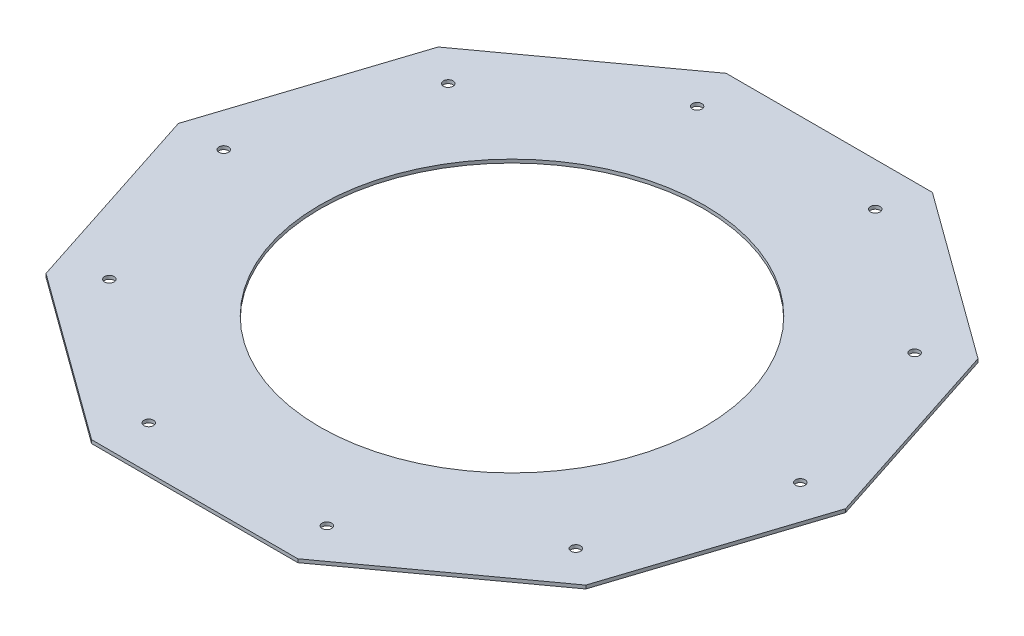
ISO-10303-21;
HEADER;
FILE_DESCRIPTION(('STEP AP214'),'2;1');
FILE_NAME('part.step','',(''),(''),'','','');
FILE_SCHEMA(('AUTOMOTIVE_DESIGN { 1 0 10303 214 1 1 1 1 }'));
ENDSEC;
DATA;
#1=APPLICATION_CONTEXT('core data for automotive mechanical design processes');
#2=APPLICATION_PROTOCOL_DEFINITION('international standard','automotive_design',2000,#1);
#3=PRODUCT_CONTEXT('',#1,'mechanical');
#4=PRODUCT('Part','Part','',(#3));
#5=PRODUCT_RELATED_PRODUCT_CATEGORY('part','',(#4));
#6=PRODUCT_DEFINITION_FORMATION('','',#4);
#7=PRODUCT_DEFINITION_CONTEXT('part definition',#1,'design');
#8=PRODUCT_DEFINITION('design','',#6,#7);
#9=PRODUCT_DEFINITION_SHAPE('','',#8);
#10=(LENGTH_UNIT() NAMED_UNIT(*) SI_UNIT(.MILLI.,.METRE.));
#11=(NAMED_UNIT(*) PLANE_ANGLE_UNIT() SI_UNIT($,.RADIAN.));
#12=(NAMED_UNIT(*) SI_UNIT($,.STERADIAN.) SOLID_ANGLE_UNIT());
#13=UNCERTAINTY_MEASURE_WITH_UNIT(LENGTH_MEASURE(1.E-05),#10,'distance_accuracy_value','');
#14=(GEOMETRIC_REPRESENTATION_CONTEXT(3) GLOBAL_UNCERTAINTY_ASSIGNED_CONTEXT((#13)) GLOBAL_UNIT_ASSIGNED_CONTEXT((#10,
#11,#12)) REPRESENTATION_CONTEXT('',''));
#15=CARTESIAN_POINT('',(0.,0.,0.));
#16=DIRECTION('',(0.,0.,1.));
#17=DIRECTION('',(1.,0.,0.));
#18=AXIS2_PLACEMENT_3D('',#15,#16,#17);
#19=CARTESIAN_POINT('',(0.,1200.,0.));
#20=DIRECTION('',(0.,1.,0.));
#21=DIRECTION('',(0.,0.,1.));
#22=AXIS2_PLACEMENT_3D('',#19,#20,#21);
#23=PLANE('',#22);
#24=CARTESIAN_POINT('',(-39.308417585108,1200.,120.978869674096));
#25=DIRECTION('',(0.,1.,0.));
#26=DIRECTION('',(0.,0.,1.));
#27=AXIS2_PLACEMENT_3D('',#24,#25,#26);
#28=CIRCLE('',#27,2.09999999999998);
#29=CARTESIAN_POINT('',(-39.308417585108,1200.,123.078869674096));
#30=VERTEX_POINT('',#29);
#31=EDGE_CURVE('E263',#30,#30,#28,.T.);
#32=ORIENTED_EDGE('',*,*,#31,.F.);
#33=EDGE_LOOP('',(#32));
#34=FACE_BOUND('',#33,.T.);
#35=CARTESIAN_POINT('',(102.91077328179,1200.,74.7690533791364));
#36=DIRECTION('',(0.,1.,0.));
#37=DIRECTION('',(0.,0.,1.));
#38=AXIS2_PLACEMENT_3D('',#35,#36,#37);
#39=CIRCLE('',#38,2.09999999999999);
#40=CARTESIAN_POINT('',(102.91077328179,1200.,76.8690533791364));
#41=VERTEX_POINT('',#40);
#42=EDGE_CURVE('E251',#41,#41,#39,.T.);
#43=ORIENTED_EDGE('',*,*,#42,.F.);
#44=EDGE_LOOP('',(#43));
#45=FACE_BOUND('',#44,.T.);
#46=CARTESIAN_POINT('',(39.3084175851137,1200.,-120.978869674102));
#47=DIRECTION('',(0.,1.,0.));
#48=DIRECTION('',(0.,0.,1.));
#49=AXIS2_PLACEMENT_3D('',#46,#47,#48);
#50=CIRCLE('',#49,2.1);
#51=CARTESIAN_POINT('',(39.3084175851137,1200.,-118.878869674102));
#52=VERTEX_POINT('',#51);
#53=EDGE_CURVE('E239',#52,#52,#50,.T.);
#54=ORIENTED_EDGE('',*,*,#53,.F.);
#55=EDGE_LOOP('',(#54));
#56=FACE_BOUND('',#55,.T.);
#57=CARTESIAN_POINT('',(-102.910773281785,1200.,-74.7690533791421));
#58=DIRECTION('',(0.,1.,0.));
#59=DIRECTION('',(0.,0.,1.));
#60=AXIS2_PLACEMENT_3D('',#57,#58,#59);
#61=CIRCLE('',#60,2.09999999999999);
#62=CARTESIAN_POINT('',(-102.910773281785,1200.,-72.6690533791421));
#63=VERTEX_POINT('',#62);
#64=EDGE_CURVE('E227',#63,#63,#61,.T.);
#65=ORIENTED_EDGE('',*,*,#64,.F.);
#66=EDGE_LOOP('',(#65));
#67=FACE_BOUND('',#66,.T.);
#68=CARTESIAN_POINT('',(-127.204711393357,1200.,-5.04680804180316E-12));
#69=DIRECTION('',(0.,1.,0.));
#70=DIRECTION('',(0.,0.,1.));
#71=AXIS2_PLACEMENT_3D('',#68,#69,#70);
#72=CIRCLE('',#71,2.09999999999999);
#73=CARTESIAN_POINT('',(-127.204711393357,1200.,2.09999999999494));
#74=VERTEX_POINT('',#73);
#75=EDGE_CURVE('E215',#74,#74,#72,.T.);
#76=ORIENTED_EDGE('',*,*,#75,.F.);
#77=EDGE_LOOP('',(#76));
#78=FACE_BOUND('',#77,.T.);
#79=DIRECTION('',(-0.309016994374947,0.,0.951056516295154));
#80=VECTOR('',#79,1.);
#81=CARTESIAN_POINT('',(-119.091113169286,1200.,-86.5247584249853));
#82=LINE('',#81,#80);
#83=CARTESIAN_POINT('',(-119.091113169286,1200.,-86.5247584249853));
#84=VERTEX_POINT('',#83);
#85=CARTESIAN_POINT('',(-147.204711393357,1200.,0.));
#86=VERTEX_POINT('',#85);
#87=EDGE_CURVE('E164',#84,#86,#82,.T.);
#88=ORIENTED_EDGE('',*,*,#87,.T.);
#89=DIRECTION('',(0.309016994374947,0.,0.951056516295154));
#90=VECTOR('',#89,1.);
#91=CARTESIAN_POINT('',(-147.204711393357,1200.,0.));
#92=LINE('',#91,#90);
#93=CARTESIAN_POINT('',(-119.091113169286,1200.,86.5247584249852));
#94=VERTEX_POINT('',#93);
#95=EDGE_CURVE('E102',#86,#94,#92,.T.);
#96=ORIENTED_EDGE('',*,*,#95,.T.);
#97=DIRECTION('',(0.809016994374947,0.,0.587785252292473));
#98=VECTOR('',#97,1.);
#99=CARTESIAN_POINT('',(-119.091113169286,1200.,86.5247584249852));
#100=LINE('',#99,#98);
#101=CARTESIAN_POINT('',(-45.4887574726069,1200.,140.));
#102=VERTEX_POINT('',#101);
#103=EDGE_CURVE('E185',#94,#102,#100,.T.);
#104=ORIENTED_EDGE('',*,*,#103,.T.);
#105=DIRECTION('',(1.,0.,0.));
#106=VECTOR('',#105,1.);
#107=CARTESIAN_POINT('',(-45.4887574726069,1200.,140.));
#108=LINE('',#107,#106);
#109=CARTESIAN_POINT('',(45.4887574726068,1200.,140.));
#110=VERTEX_POINT('',#109);
#111=EDGE_CURVE('E204',#102,#110,#108,.T.);
#112=ORIENTED_EDGE('',*,*,#111,.T.);
#113=DIRECTION('',(0.809016994374948,0.,-0.587785252292473));
#114=VECTOR('',#113,1.);
#115=CARTESIAN_POINT('',(45.4887574726068,1200.,140.));
#116=LINE('',#115,#114);
#117=CARTESIAN_POINT('',(119.091113169286,1200.,86.5247584249853));
#118=VERTEX_POINT('',#117);
#119=EDGE_CURVE('E201',#110,#118,#116,.T.);
#120=ORIENTED_EDGE('',*,*,#119,.T.);
#121=DIRECTION('',(0.309016994374947,0.,-0.951056516295154));
#122=VECTOR('',#121,1.);
#123=CARTESIAN_POINT('',(119.091113169286,1200.,86.5247584249853));
#124=LINE('',#123,#122);
#125=CARTESIAN_POINT('',(147.204711393357,1200.,0.));
#126=VERTEX_POINT('',#125);
#127=EDGE_CURVE('E203',#118,#126,#124,.T.);
#128=ORIENTED_EDGE('',*,*,#127,.T.);
#129=DIRECTION('',(-0.309016994374947,0.,-0.951056516295154));
#130=VECTOR('',#129,1.);
#131=CARTESIAN_POINT('',(147.204711393357,1200.,0.));
#132=LINE('',#131,#130);
#133=CARTESIAN_POINT('',(119.091113169286,1200.,-86.5247584249853));
#134=VERTEX_POINT('',#133);
#135=EDGE_CURVE('E127',#126,#134,#132,.T.);
#136=ORIENTED_EDGE('',*,*,#135,.T.);
#137=DIRECTION('',(-0.809016994374947,0.,-0.587785252292473));
#138=VECTOR('',#137,1.);
#139=CARTESIAN_POINT('',(119.091113169286,1200.,-86.5247584249853));
#140=LINE('',#139,#138);
#141=CARTESIAN_POINT('',(45.4887574726069,1200.,-140.));
#142=VERTEX_POINT('',#141);
#143=EDGE_CURVE('E121',#134,#142,#140,.T.);
#144=ORIENTED_EDGE('',*,*,#143,.T.);
#145=DIRECTION('',(-1.,0.,0.));
#146=VECTOR('',#145,1.);
#147=CARTESIAN_POINT('',(45.4887574726069,1200.,-140.));
#148=LINE('',#147,#146);
#149=CARTESIAN_POINT('',(-45.4887574726068,1200.,-140.));
#150=VERTEX_POINT('',#149);
#151=EDGE_CURVE('E125',#142,#150,#148,.T.);
#152=ORIENTED_EDGE('',*,*,#151,.T.);
#153=DIRECTION('',(-0.809016994374948,0.,0.587785252292473));
#154=VECTOR('',#153,1.);
#155=CARTESIAN_POINT('',(-45.4887574726068,1200.,-140.));
#156=LINE('',#155,#154);
#157=EDGE_CURVE('E53',#150,#84,#156,.T.);
#158=ORIENTED_EDGE('',*,*,#157,.T.);
#159=EDGE_LOOP('',(#88,#96,#104,#112,#120,#128,#136,#144,#152,#158));
#160=FACE_BOUND('',#159,.T.);
#161=CARTESIAN_POINT('',(0.,1200.,0.));
#162=DIRECTION('',(0.,1.,0.));
#163=DIRECTION('',(0.,0.,1.));
#164=AXIS2_PLACEMENT_3D('',#161,#162,#163);
#165=CIRCLE('',#164,84.8);
#166=CARTESIAN_POINT('',(0.,1200.,84.8));
#167=VERTEX_POINT('',#166);
#168=EDGE_CURVE('E149',#167,#167,#165,.T.);
#169=ORIENTED_EDGE('',*,*,#168,.F.);
#170=EDGE_LOOP('',(#169));
#171=FACE_BOUND('',#170,.T.);
#172=CARTESIAN_POINT('',(102.910773281793,1200.,-74.7690533791385));
#173=DIRECTION('',(0.,1.,0.));
#174=DIRECTION('',(0.,0.,1.));
#175=AXIS2_PLACEMENT_3D('',#172,#173,#174);
#176=CIRCLE('',#175,2.1);
#177=CARTESIAN_POINT('',(102.910773281793,1200.,-72.6690533791385));
#178=VERTEX_POINT('',#177);
#179=EDGE_CURVE('E221',#178,#178,#176,.T.);
#180=ORIENTED_EDGE('',*,*,#179,.F.);
#181=EDGE_LOOP('',(#180));
#182=FACE_BOUND('',#181,.T.);
#183=CARTESIAN_POINT('',(-39.3084175851039,1200.,-120.978869674103));
#184=DIRECTION('',(0.,1.,0.));
#185=DIRECTION('',(0.,0.,1.));
#186=AXIS2_PLACEMENT_3D('',#183,#184,#185);
#187=CIRCLE('',#186,2.10000000000001);
#188=CARTESIAN_POINT('',(-39.3084175851039,1200.,-118.878869674103));
#189=VERTEX_POINT('',#188);
#190=EDGE_CURVE('E233',#189,#189,#187,.T.);
#191=ORIENTED_EDGE('',*,*,#190,.F.);
#192=EDGE_LOOP('',(#191));
#193=FACE_BOUND('',#192,.T.);
#194=CARTESIAN_POINT('',(127.204711393363,1200.,-6.58663043665205E-13));
#195=DIRECTION('',(0.,1.,0.));
#196=DIRECTION('',(0.,0.,1.));
#197=AXIS2_PLACEMENT_3D('',#194,#195,#196);
#198=CIRCLE('',#197,2.09999999999999);
#199=CARTESIAN_POINT('',(127.204711393363,1200.,2.09999999999933));
#200=VERTEX_POINT('',#199);
#201=EDGE_CURVE('E245',#200,#200,#198,.T.);
#202=ORIENTED_EDGE('',*,*,#201,.F.);
#203=EDGE_LOOP('',(#202));
#204=FACE_BOUND('',#203,.T.);
#205=CARTESIAN_POINT('',(39.3084175851096,1200.,120.978869674097));
#206=DIRECTION('',(0.,1.,0.));
#207=DIRECTION('',(0.,0.,1.));
#208=AXIS2_PLACEMENT_3D('',#205,#206,#207);
#209=CIRCLE('',#208,2.1);
#210=CARTESIAN_POINT('',(39.3084175851096,1200.,123.078869674097));
#211=VERTEX_POINT('',#210);
#212=EDGE_CURVE('E257',#211,#211,#209,.T.);
#213=ORIENTED_EDGE('',*,*,#212,.F.);
#214=EDGE_LOOP('',(#213));
#215=FACE_BOUND('',#214,.T.);
#216=CARTESIAN_POINT('',(-102.910773281787,1200.,74.7690533791329));
#217=DIRECTION('',(0.,1.,0.));
#218=DIRECTION('',(0.,0.,1.));
#219=AXIS2_PLACEMENT_3D('',#216,#217,#218);
#220=CIRCLE('',#219,2.09999999999999);
#221=CARTESIAN_POINT('',(-102.910773281787,1200.,76.8690533791329));
#222=VERTEX_POINT('',#221);
#223=EDGE_CURVE('E269',#222,#222,#220,.T.);
#224=ORIENTED_EDGE('',*,*,#223,.F.);
#225=EDGE_LOOP('',(#224));
#226=FACE_BOUND('',#225,.T.);
#227=ADVANCED_FACE('F36',(#34,#45,#56,#67,#78,#160,#171,#182,#193,#204,#215,#226),#23,.T.);
#228=CARTESIAN_POINT('',(0.,1198.5,0.));
#229=DIRECTION('',(0.,1.,0.));
#230=DIRECTION('',(0.,0.,1.));
#231=AXIS2_PLACEMENT_3D('',#228,#229,#230);
#232=PLANE('',#231);
#233=DIRECTION('',(-0.309016994374947,0.,0.951056516295154));
#234=VECTOR('',#233,1.);
#235=CARTESIAN_POINT('',(-119.091113169286,1198.5,-86.5247584249853));
#236=LINE('',#235,#234);
#237=CARTESIAN_POINT('',(-119.091113169286,1198.5,-86.5247584249853));
#238=VERTEX_POINT('',#237);
#239=CARTESIAN_POINT('',(-147.204711393357,1198.5,0.));
#240=VERTEX_POINT('',#239);
#241=EDGE_CURVE('E145',#238,#240,#236,.T.);
#242=ORIENTED_EDGE('',*,*,#241,.F.);
#243=DIRECTION('',(-0.809016994374948,0.,0.587785252292473));
#244=VECTOR('',#243,1.);
#245=CARTESIAN_POINT('',(-45.4887574726068,1198.5,-140.));
#246=LINE('',#245,#244);
#247=CARTESIAN_POINT('',(-45.4887574726068,1198.5,-140.));
#248=VERTEX_POINT('',#247);
#249=EDGE_CURVE('E94',#248,#238,#246,.T.);
#250=ORIENTED_EDGE('',*,*,#249,.F.);
#251=DIRECTION('',(-1.,0.,0.));
#252=VECTOR('',#251,1.);
#253=CARTESIAN_POINT('',(45.4887574726069,1198.5,-140.));
#254=LINE('',#253,#252);
#255=CARTESIAN_POINT('',(45.4887574726069,1198.5,-140.));
#256=VERTEX_POINT('',#255);
#257=EDGE_CURVE('E88',#256,#248,#254,.T.);
#258=ORIENTED_EDGE('',*,*,#257,.F.);
#259=DIRECTION('',(-0.809016994374947,0.,-0.587785252292473));
#260=VECTOR('',#259,1.);
#261=CARTESIAN_POINT('',(119.091113169286,1198.5,-86.5247584249853));
#262=LINE('',#261,#260);
#263=CARTESIAN_POINT('',(119.091113169286,1198.5,-86.5247584249853));
#264=VERTEX_POINT('',#263);
#265=EDGE_CURVE('E135',#264,#256,#262,.T.);
#266=ORIENTED_EDGE('',*,*,#265,.F.);
#267=DIRECTION('',(-0.309016994374947,0.,-0.951056516295154));
#268=VECTOR('',#267,1.);
#269=CARTESIAN_POINT('',(147.204711393357,1198.5,0.));
#270=LINE('',#269,#268);
#271=CARTESIAN_POINT('',(147.204711393357,1198.5,0.));
#272=VERTEX_POINT('',#271);
#273=EDGE_CURVE('E159',#272,#264,#270,.T.);
#274=ORIENTED_EDGE('',*,*,#273,.F.);
#275=DIRECTION('',(0.309016994374947,0.,-0.951056516295154));
#276=VECTOR('',#275,1.);
#277=CARTESIAN_POINT('',(119.091113169286,1198.5,86.5247584249853));
#278=LINE('',#277,#276);
#279=CARTESIAN_POINT('',(119.091113169286,1198.5,86.5247584249853));
#280=VERTEX_POINT('',#279);
#281=EDGE_CURVE('E157',#280,#272,#278,.T.);
#282=ORIENTED_EDGE('',*,*,#281,.F.);
#283=DIRECTION('',(0.809016994374948,0.,-0.587785252292473));
#284=VECTOR('',#283,1.);
#285=CARTESIAN_POINT('',(45.4887574726068,1198.5,140.));
#286=LINE('',#285,#284);
#287=CARTESIAN_POINT('',(45.4887574726068,1198.5,140.));
#288=VERTEX_POINT('',#287);
#289=EDGE_CURVE('E155',#288,#280,#286,.T.);
#290=ORIENTED_EDGE('',*,*,#289,.F.);
#291=DIRECTION('',(1.,0.,0.));
#292=VECTOR('',#291,1.);
#293=CARTESIAN_POINT('',(-45.4887574726069,1198.5,140.));
#294=LINE('',#293,#292);
#295=CARTESIAN_POINT('',(-45.4887574726069,1198.5,140.));
#296=VERTEX_POINT('',#295);
#297=EDGE_CURVE('E153',#296,#288,#294,.T.);
#298=ORIENTED_EDGE('',*,*,#297,.F.);
#299=DIRECTION('',(0.809016994374947,0.,0.587785252292473));
#300=VECTOR('',#299,1.);
#301=CARTESIAN_POINT('',(-119.091113169286,1198.5,86.5247584249852));
#302=LINE('',#301,#300);
#303=CARTESIAN_POINT('',(-119.091113169286,1198.5,86.5247584249852));
#304=VERTEX_POINT('',#303);
#305=EDGE_CURVE('E151',#304,#296,#302,.T.);
#306=ORIENTED_EDGE('',*,*,#305,.F.);
#307=DIRECTION('',(0.309016994374947,0.,0.951056516295154));
#308=VECTOR('',#307,1.);
#309=CARTESIAN_POINT('',(-147.204711393357,1198.5,0.));
#310=LINE('',#309,#308);
#311=EDGE_CURVE('E148',#240,#304,#310,.T.);
#312=ORIENTED_EDGE('',*,*,#311,.F.);
#313=EDGE_LOOP('',(#242,#250,#258,#266,#274,#282,#290,#298,#306,#312));
#314=FACE_BOUND('',#313,.T.);
#315=CARTESIAN_POINT('',(0.,1198.5,0.));
#316=DIRECTION('',(0.,1.,0.));
#317=DIRECTION('',(0.,0.,1.));
#318=AXIS2_PLACEMENT_3D('',#315,#316,#317);
#319=CIRCLE('',#318,84.8);
#320=CARTESIAN_POINT('',(0.,1198.5,84.8));
#321=VERTEX_POINT('',#320);
#322=EDGE_CURVE('E212',#321,#321,#319,.T.);
#323=ORIENTED_EDGE('',*,*,#322,.T.);
#324=EDGE_LOOP('',(#323));
#325=FACE_BOUND('',#324,.T.);
#326=CARTESIAN_POINT('',(-127.204711393357,1198.5,-5.04680804180316E-12));
#327=DIRECTION('',(0.,1.,0.));
#328=DIRECTION('',(0.,0.,1.));
#329=AXIS2_PLACEMENT_3D('',#326,#327,#328);
#330=CIRCLE('',#329,2.09999999999999);
#331=CARTESIAN_POINT('',(-127.204711393357,1198.5,2.09999999999494));
#332=VERTEX_POINT('',#331);
#333=EDGE_CURVE('E218',#332,#332,#330,.T.);
#334=ORIENTED_EDGE('',*,*,#333,.T.);
#335=EDGE_LOOP('',(#334));
#336=FACE_BOUND('',#335,.T.);
#337=CARTESIAN_POINT('',(102.910773281793,1198.5,-74.7690533791385));
#338=DIRECTION('',(0.,1.,0.));
#339=DIRECTION('',(0.,0.,1.));
#340=AXIS2_PLACEMENT_3D('',#337,#338,#339);
#341=CIRCLE('',#340,2.1);
#342=CARTESIAN_POINT('',(102.910773281793,1198.5,-72.6690533791385));
#343=VERTEX_POINT('',#342);
#344=EDGE_CURVE('E224',#343,#343,#341,.T.);
#345=ORIENTED_EDGE('',*,*,#344,.T.);
#346=EDGE_LOOP('',(#345));
#347=FACE_BOUND('',#346,.T.);
#348=CARTESIAN_POINT('',(-102.910773281785,1198.5,-74.7690533791421));
#349=DIRECTION('',(0.,1.,0.));
#350=DIRECTION('',(0.,0.,1.));
#351=AXIS2_PLACEMENT_3D('',#348,#349,#350);
#352=CIRCLE('',#351,2.09999999999999);
#353=CARTESIAN_POINT('',(-102.910773281785,1198.5,-72.6690533791421));
#354=VERTEX_POINT('',#353);
#355=EDGE_CURVE('E230',#354,#354,#352,.T.);
#356=ORIENTED_EDGE('',*,*,#355,.T.);
#357=EDGE_LOOP('',(#356));
#358=FACE_BOUND('',#357,.T.);
#359=CARTESIAN_POINT('',(-39.3084175851039,1198.5,-120.978869674103));
#360=DIRECTION('',(0.,1.,0.));
#361=DIRECTION('',(0.,0.,1.));
#362=AXIS2_PLACEMENT_3D('',#359,#360,#361);
#363=CIRCLE('',#362,2.10000000000001);
#364=CARTESIAN_POINT('',(-39.3084175851039,1198.5,-118.878869674103));
#365=VERTEX_POINT('',#364);
#366=EDGE_CURVE('E236',#365,#365,#363,.T.);
#367=ORIENTED_EDGE('',*,*,#366,.T.);
#368=EDGE_LOOP('',(#367));
#369=FACE_BOUND('',#368,.T.);
#370=CARTESIAN_POINT('',(39.3084175851137,1198.5,-120.978869674102));
#371=DIRECTION('',(0.,1.,0.));
#372=DIRECTION('',(0.,0.,1.));
#373=AXIS2_PLACEMENT_3D('',#370,#371,#372);
#374=CIRCLE('',#373,2.1);
#375=CARTESIAN_POINT('',(39.3084175851137,1198.5,-118.878869674102));
#376=VERTEX_POINT('',#375);
#377=EDGE_CURVE('E242',#376,#376,#374,.T.);
#378=ORIENTED_EDGE('',*,*,#377,.T.);
#379=EDGE_LOOP('',(#378));
#380=FACE_BOUND('',#379,.T.);
#381=CARTESIAN_POINT('',(127.204711393363,1198.5,-6.58663043665205E-13));
#382=DIRECTION('',(0.,1.,0.));
#383=DIRECTION('',(0.,0.,1.));
#384=AXIS2_PLACEMENT_3D('',#381,#382,#383);
#385=CIRCLE('',#384,2.09999999999999);
#386=CARTESIAN_POINT('',(127.204711393363,1198.5,2.09999999999933));
#387=VERTEX_POINT('',#386);
#388=EDGE_CURVE('E248',#387,#387,#385,.T.);
#389=ORIENTED_EDGE('',*,*,#388,.T.);
#390=EDGE_LOOP('',(#389));
#391=FACE_BOUND('',#390,.T.);
#392=CARTESIAN_POINT('',(102.91077328179,1198.5,74.7690533791364));
#393=DIRECTION('',(0.,1.,0.));
#394=DIRECTION('',(0.,0.,1.));
#395=AXIS2_PLACEMENT_3D('',#392,#393,#394);
#396=CIRCLE('',#395,2.09999999999999);
#397=CARTESIAN_POINT('',(102.91077328179,1198.5,76.8690533791364));
#398=VERTEX_POINT('',#397);
#399=EDGE_CURVE('E254',#398,#398,#396,.T.);
#400=ORIENTED_EDGE('',*,*,#399,.T.);
#401=EDGE_LOOP('',(#400));
#402=FACE_BOUND('',#401,.T.);
#403=CARTESIAN_POINT('',(39.3084175851096,1198.5,120.978869674097));
#404=DIRECTION('',(0.,1.,0.));
#405=DIRECTION('',(0.,0.,1.));
#406=AXIS2_PLACEMENT_3D('',#403,#404,#405);
#407=CIRCLE('',#406,2.1);
#408=CARTESIAN_POINT('',(39.3084175851096,1198.5,123.078869674097));
#409=VERTEX_POINT('',#408);
#410=EDGE_CURVE('E260',#409,#409,#407,.T.);
#411=ORIENTED_EDGE('',*,*,#410,.T.);
#412=EDGE_LOOP('',(#411));
#413=FACE_BOUND('',#412,.T.);
#414=CARTESIAN_POINT('',(-39.308417585108,1198.5,120.978869674096));
#415=DIRECTION('',(0.,1.,0.));
#416=DIRECTION('',(0.,0.,1.));
#417=AXIS2_PLACEMENT_3D('',#414,#415,#416);
#418=CIRCLE('',#417,2.09999999999998);
#419=CARTESIAN_POINT('',(-39.308417585108,1198.5,123.078869674096));
#420=VERTEX_POINT('',#419);
#421=EDGE_CURVE('E266',#420,#420,#418,.T.);
#422=ORIENTED_EDGE('',*,*,#421,.T.);
#423=EDGE_LOOP('',(#422));
#424=FACE_BOUND('',#423,.T.);
#425=CARTESIAN_POINT('',(-102.910773281787,1198.5,74.7690533791329));
#426=DIRECTION('',(0.,1.,0.));
#427=DIRECTION('',(0.,0.,1.));
#428=AXIS2_PLACEMENT_3D('',#425,#426,#427);
#429=CIRCLE('',#428,2.09999999999999);
#430=CARTESIAN_POINT('',(-102.910773281787,1198.5,76.8690533791329));
#431=VERTEX_POINT('',#430);
#432=EDGE_CURVE('E272',#431,#431,#429,.T.);
#433=ORIENTED_EDGE('',*,*,#432,.T.);
#434=EDGE_LOOP('',(#433));
#435=FACE_BOUND('',#434,.T.);
#436=ADVANCED_FACE('F189',(#314,#325,#336,#347,#358,#369,#380,#391,#402,#413,#424,#435),#232,.F.);
#437=CARTESIAN_POINT('',(-119.091113169286,1200.,-86.5247584249853));
#438=DIRECTION('',(0.951056516295154,0.,0.309016994374947));
#439=DIRECTION('',(0.309016994374947,0.,-0.951056516295154));
#440=AXIS2_PLACEMENT_3D('',#437,#438,#439);
#441=PLANE('',#440);
#442=ORIENTED_EDGE('',*,*,#241,.T.);
#443=DIRECTION('',(0.,-1.,0.));
#444=VECTOR('',#443,1.);
#445=CARTESIAN_POINT('',(-147.204711393357,1200.,0.));
#446=LINE('',#445,#444);
#447=EDGE_CURVE('E11',#86,#240,#446,.T.);
#448=ORIENTED_EDGE('',*,*,#447,.F.);
#449=ORIENTED_EDGE('',*,*,#87,.F.);
#450=DIRECTION('',(0.,-1.,0.));
#451=VECTOR('',#450,1.);
#452=CARTESIAN_POINT('',(-119.091113169286,1200.,-86.5247584249853));
#453=LINE('',#452,#451);
#454=EDGE_CURVE('E141',#84,#238,#453,.T.);
#455=ORIENTED_EDGE('',*,*,#454,.T.);
#456=EDGE_LOOP('',(#442,#448,#449,#455));
#457=FACE_BOUND('',#456,.T.);
#458=ADVANCED_FACE('F38',(#457),#441,.F.);
#459=CARTESIAN_POINT('',(-147.204711393357,1200.,0.));
#460=DIRECTION('',(0.951056516295154,0.,-0.309016994374947));
#461=DIRECTION('',(-0.309016994374947,0.,-0.951056516295154));
#462=AXIS2_PLACEMENT_3D('',#459,#460,#461);
#463=PLANE('',#462);
#464=ORIENTED_EDGE('',*,*,#311,.T.);
#465=DIRECTION('',(0.,-1.,0.));
#466=VECTOR('',#465,1.);
#467=CARTESIAN_POINT('',(-119.091113169286,1200.,86.5247584249852));
#468=LINE('',#467,#466);
#469=EDGE_CURVE('E45',#94,#304,#468,.T.);
#470=ORIENTED_EDGE('',*,*,#469,.F.);
#471=ORIENTED_EDGE('',*,*,#95,.F.);
#472=ORIENTED_EDGE('',*,*,#447,.T.);
#473=EDGE_LOOP('',(#464,#470,#471,#472));
#474=FACE_BOUND('',#473,.T.);
#475=ADVANCED_FACE('F314',(#474),#463,.F.);
#476=CARTESIAN_POINT('',(-119.091113169286,1200.,86.5247584249852));
#477=DIRECTION('',(0.587785252292473,0.,-0.809016994374947));
#478=DIRECTION('',(-0.809016994374947,0.,-0.587785252292473));
#479=AXIS2_PLACEMENT_3D('',#476,#477,#478);
#480=PLANE('',#479);
#481=ORIENTED_EDGE('',*,*,#305,.T.);
#482=DIRECTION('',(0.,-1.,0.));
#483=VECTOR('',#482,1.);
#484=CARTESIAN_POINT('',(-45.4887574726069,1200.,140.));
#485=LINE('',#484,#483);
#486=EDGE_CURVE('E177',#102,#296,#485,.T.);
#487=ORIENTED_EDGE('',*,*,#486,.F.);
#488=ORIENTED_EDGE('',*,*,#103,.F.);
#489=ORIENTED_EDGE('',*,*,#469,.T.);
#490=EDGE_LOOP('',(#481,#487,#488,#489));
#491=FACE_BOUND('',#490,.T.);
#492=ADVANCED_FACE('F183',(#491),#480,.F.);
#493=CARTESIAN_POINT('',(-45.4887574726069,1200.,140.));
#494=DIRECTION('',(0.,0.,-1.));
#495=DIRECTION('',(-1.,0.,0.));
#496=AXIS2_PLACEMENT_3D('',#493,#494,#495);
#497=PLANE('',#496);
#498=ORIENTED_EDGE('',*,*,#297,.T.);
#499=DIRECTION('',(0.,-1.,0.));
#500=VECTOR('',#499,1.);
#501=CARTESIAN_POINT('',(45.4887574726068,1200.,140.));
#502=LINE('',#501,#500);
#503=EDGE_CURVE('E174',#110,#288,#502,.T.);
#504=ORIENTED_EDGE('',*,*,#503,.F.);
#505=ORIENTED_EDGE('',*,*,#111,.F.);
#506=ORIENTED_EDGE('',*,*,#486,.T.);
#507=EDGE_LOOP('',(#498,#504,#505,#506));
#508=FACE_BOUND('',#507,.T.);
#509=ADVANCED_FACE('F195',(#508),#497,.F.);
#510=CARTESIAN_POINT('',(45.4887574726068,1200.,140.));
#511=DIRECTION('',(-0.587785252292473,0.,-0.809016994374947));
#512=DIRECTION('',(-0.809016994374948,0.,0.587785252292473));
#513=AXIS2_PLACEMENT_3D('',#510,#511,#512);
#514=PLANE('',#513);
#515=ORIENTED_EDGE('',*,*,#289,.T.);
#516=DIRECTION('',(0.,-1.,0.));
#517=VECTOR('',#516,1.);
#518=CARTESIAN_POINT('',(119.091113169286,1200.,86.5247584249853));
#519=LINE('',#518,#517);
#520=EDGE_CURVE('E171',#118,#280,#519,.T.);
#521=ORIENTED_EDGE('',*,*,#520,.F.);
#522=ORIENTED_EDGE('',*,*,#119,.F.);
#523=ORIENTED_EDGE('',*,*,#503,.T.);
#524=EDGE_LOOP('',(#515,#521,#522,#523));
#525=FACE_BOUND('',#524,.T.);
#526=ADVANCED_FACE('F199',(#525),#514,.F.);
#527=CARTESIAN_POINT('',(119.091113169286,1200.,86.5247584249853));
#528=DIRECTION('',(-0.951056516295154,0.,-0.309016994374947));
#529=DIRECTION('',(-0.309016994374947,0.,0.951056516295154));
#530=AXIS2_PLACEMENT_3D('',#527,#528,#529);
#531=PLANE('',#530);
#532=ORIENTED_EDGE('',*,*,#281,.T.);
#533=DIRECTION('',(0.,-1.,0.));
#534=VECTOR('',#533,1.);
#535=CARTESIAN_POINT('',(147.204711393357,1200.,0.));
#536=LINE('',#535,#534);
#537=EDGE_CURVE('E168',#126,#272,#536,.T.);
#538=ORIENTED_EDGE('',*,*,#537,.F.);
#539=ORIENTED_EDGE('',*,*,#127,.F.);
#540=ORIENTED_EDGE('',*,*,#520,.T.);
#541=EDGE_LOOP('',(#532,#538,#539,#540));
#542=FACE_BOUND('',#541,.T.);
#543=ADVANCED_FACE('F304',(#542),#531,.F.);
#544=CARTESIAN_POINT('',(147.204711393357,1200.,0.));
#545=DIRECTION('',(-0.951056516295154,0.,0.309016994374947));
#546=DIRECTION('',(0.309016994374947,0.,0.951056516295154));
#547=AXIS2_PLACEMENT_3D('',#544,#545,#546);
#548=PLANE('',#547);
#549=ORIENTED_EDGE('',*,*,#273,.T.);
#550=DIRECTION('',(0.,-1.,0.));
#551=VECTOR('',#550,1.);
#552=CARTESIAN_POINT('',(119.091113169286,1200.,-86.5247584249853));
#553=LINE('',#552,#551);
#554=EDGE_CURVE('E136',#134,#264,#553,.T.);
#555=ORIENTED_EDGE('',*,*,#554,.F.);
#556=ORIENTED_EDGE('',*,*,#135,.F.);
#557=ORIENTED_EDGE('',*,*,#537,.T.);
#558=EDGE_LOOP('',(#549,#555,#556,#557));
#559=FACE_BOUND('',#558,.T.);
#560=ADVANCED_FACE('F301',(#559),#548,.F.);
#561=CARTESIAN_POINT('',(119.091113169286,1200.,-86.5247584249853));
#562=DIRECTION('',(-0.587785252292473,0.,0.809016994374947));
#563=DIRECTION('',(0.809016994374948,0.,0.587785252292473));
#564=AXIS2_PLACEMENT_3D('',#561,#562,#563);
#565=PLANE('',#564);
#566=ORIENTED_EDGE('',*,*,#265,.T.);
#567=DIRECTION('',(0.,-1.,0.));
#568=VECTOR('',#567,1.);
#569=CARTESIAN_POINT('',(45.4887574726069,1200.,-140.));
#570=LINE('',#569,#568);
#571=EDGE_CURVE('E132',#142,#256,#570,.T.);
#572=ORIENTED_EDGE('',*,*,#571,.F.);
#573=ORIENTED_EDGE('',*,*,#143,.F.);
#574=ORIENTED_EDGE('',*,*,#554,.T.);
#575=EDGE_LOOP('',(#566,#572,#573,#574));
#576=FACE_BOUND('',#575,.T.);
#577=ADVANCED_FACE('F133',(#576),#565,.F.);
#578=CARTESIAN_POINT('',(45.4887574726069,1200.,-140.));
#579=DIRECTION('',(0.,0.,1.));
#580=DIRECTION('',(1.,0.,0.));
#581=AXIS2_PLACEMENT_3D('',#578,#579,#580);
#582=PLANE('',#581);
#583=ORIENTED_EDGE('',*,*,#257,.T.);
#584=DIRECTION('',(0.,-1.,0.));
#585=VECTOR('',#584,1.);
#586=CARTESIAN_POINT('',(-45.4887574726068,1200.,-140.));
#587=LINE('',#586,#585);
#588=EDGE_CURVE('E137',#150,#248,#587,.T.);
#589=ORIENTED_EDGE('',*,*,#588,.F.);
#590=ORIENTED_EDGE('',*,*,#151,.F.);
#591=ORIENTED_EDGE('',*,*,#571,.T.);
#592=EDGE_LOOP('',(#583,#589,#590,#591));
#593=FACE_BOUND('',#592,.T.);
#594=ADVANCED_FACE('F139',(#593),#582,.F.);
#595=CARTESIAN_POINT('',(-45.4887574726068,1200.,-140.));
#596=DIRECTION('',(0.587785252292473,0.,0.809016994374948));
#597=DIRECTION('',(0.809016994374948,0.,-0.587785252292473));
#598=AXIS2_PLACEMENT_3D('',#595,#596,#597);
#599=PLANE('',#598);
#600=ORIENTED_EDGE('',*,*,#249,.T.);
#601=ORIENTED_EDGE('',*,*,#454,.F.);
#602=ORIENTED_EDGE('',*,*,#157,.F.);
#603=ORIENTED_EDGE('',*,*,#588,.T.);
#604=EDGE_LOOP('',(#600,#601,#602,#603));
#605=FACE_BOUND('',#604,.T.);
#606=ADVANCED_FACE('F294',(#605),#599,.F.);
#607=CARTESIAN_POINT('',(0.,1200.,0.));
#608=DIRECTION('',(0.,-1.,0.));
#609=DIRECTION('',(0.,0.,-1.));
#610=AXIS2_PLACEMENT_3D('',#607,#608,#609);
#611=CYLINDRICAL_SURFACE('',#610,84.8);
#612=ORIENTED_EDGE('',*,*,#168,.T.);
#613=EDGE_LOOP('',(#612));
#614=FACE_BOUND('',#613,.T.);
#615=ORIENTED_EDGE('',*,*,#322,.F.);
#616=EDGE_LOOP('',(#615));
#617=FACE_BOUND('',#616,.T.);
#618=ADVANCED_FACE('F291',(#614,#617),#611,.F.);
#619=CARTESIAN_POINT('',(-127.204711393357,1200.,-5.04680804180316E-12));
#620=DIRECTION('',(0.,-1.,0.));
#621=DIRECTION('',(0.,0.,-1.));
#622=AXIS2_PLACEMENT_3D('',#619,#620,#621);
#623=CYLINDRICAL_SURFACE('',#622,2.09999999999999);
#624=ORIENTED_EDGE('',*,*,#75,.T.);
#625=EDGE_LOOP('',(#624));
#626=FACE_BOUND('',#625,.T.);
#627=ORIENTED_EDGE('',*,*,#333,.F.);
#628=EDGE_LOOP('',(#627));
#629=FACE_BOUND('',#628,.T.);
#630=ADVANCED_FACE('F395',(#626,#629),#623,.F.);
#631=CARTESIAN_POINT('',(102.910773281793,1200.,-74.7690533791385));
#632=DIRECTION('',(0.,-1.,0.));
#633=DIRECTION('',(0.,0.,-1.));
#634=AXIS2_PLACEMENT_3D('',#631,#632,#633);
#635=CYLINDRICAL_SURFACE('',#634,2.1);
#636=ORIENTED_EDGE('',*,*,#179,.T.);
#637=EDGE_LOOP('',(#636));
#638=FACE_BOUND('',#637,.T.);
#639=ORIENTED_EDGE('',*,*,#344,.F.);
#640=EDGE_LOOP('',(#639));
#641=FACE_BOUND('',#640,.T.);
#642=ADVANCED_FACE('F403',(#638,#641),#635,.F.);
#643=CARTESIAN_POINT('',(-102.910773281785,1200.,-74.7690533791421));
#644=DIRECTION('',(0.,-1.,0.));
#645=DIRECTION('',(0.,0.,-1.));
#646=AXIS2_PLACEMENT_3D('',#643,#644,#645);
#647=CYLINDRICAL_SURFACE('',#646,2.09999999999999);
#648=ORIENTED_EDGE('',*,*,#64,.T.);
#649=EDGE_LOOP('',(#648));
#650=FACE_BOUND('',#649,.T.);
#651=ORIENTED_EDGE('',*,*,#355,.F.);
#652=EDGE_LOOP('',(#651));
#653=FACE_BOUND('',#652,.T.);
#654=ADVANCED_FACE('F411',(#650,#653),#647,.F.);
#655=CARTESIAN_POINT('',(-39.3084175851039,1200.,-120.978869674103));
#656=DIRECTION('',(0.,-1.,0.));
#657=DIRECTION('',(0.,0.,-1.));
#658=AXIS2_PLACEMENT_3D('',#655,#656,#657);
#659=CYLINDRICAL_SURFACE('',#658,2.10000000000001);
#660=ORIENTED_EDGE('',*,*,#190,.T.);
#661=EDGE_LOOP('',(#660));
#662=FACE_BOUND('',#661,.T.);
#663=ORIENTED_EDGE('',*,*,#366,.F.);
#664=EDGE_LOOP('',(#663));
#665=FACE_BOUND('',#664,.T.);
#666=ADVANCED_FACE('F420',(#662,#665),#659,.F.);
#667=CARTESIAN_POINT('',(39.3084175851137,1200.,-120.978869674102));
#668=DIRECTION('',(0.,-1.,0.));
#669=DIRECTION('',(0.,0.,-1.));
#670=AXIS2_PLACEMENT_3D('',#667,#668,#669);
#671=CYLINDRICAL_SURFACE('',#670,2.1);
#672=ORIENTED_EDGE('',*,*,#53,.T.);
#673=EDGE_LOOP('',(#672));
#674=FACE_BOUND('',#673,.T.);
#675=ORIENTED_EDGE('',*,*,#377,.F.);
#676=EDGE_LOOP('',(#675));
#677=FACE_BOUND('',#676,.T.);
#678=ADVANCED_FACE('F429',(#674,#677),#671,.F.);
#679=CARTESIAN_POINT('',(127.204711393363,1200.,-6.58663043665205E-13));
#680=DIRECTION('',(0.,-1.,0.));
#681=DIRECTION('',(0.,0.,-1.));
#682=AXIS2_PLACEMENT_3D('',#679,#680,#681);
#683=CYLINDRICAL_SURFACE('',#682,2.09999999999999);
#684=ORIENTED_EDGE('',*,*,#201,.T.);
#685=EDGE_LOOP('',(#684));
#686=FACE_BOUND('',#685,.T.);
#687=ORIENTED_EDGE('',*,*,#388,.F.);
#688=EDGE_LOOP('',(#687));
#689=FACE_BOUND('',#688,.T.);
#690=ADVANCED_FACE('F438',(#686,#689),#683,.F.);
#691=CARTESIAN_POINT('',(102.91077328179,1200.,74.7690533791364));
#692=DIRECTION('',(0.,-1.,0.));
#693=DIRECTION('',(0.,0.,-1.));
#694=AXIS2_PLACEMENT_3D('',#691,#692,#693);
#695=CYLINDRICAL_SURFACE('',#694,2.09999999999999);
#696=ORIENTED_EDGE('',*,*,#42,.T.);
#697=EDGE_LOOP('',(#696));
#698=FACE_BOUND('',#697,.T.);
#699=ORIENTED_EDGE('',*,*,#399,.F.);
#700=EDGE_LOOP('',(#699));
#701=FACE_BOUND('',#700,.T.);
#702=ADVANCED_FACE('F447',(#698,#701),#695,.F.);
#703=CARTESIAN_POINT('',(39.3084175851096,1200.,120.978869674097));
#704=DIRECTION('',(0.,-1.,0.));
#705=DIRECTION('',(0.,0.,-1.));
#706=AXIS2_PLACEMENT_3D('',#703,#704,#705);
#707=CYLINDRICAL_SURFACE('',#706,2.1);
#708=ORIENTED_EDGE('',*,*,#212,.T.);
#709=EDGE_LOOP('',(#708));
#710=FACE_BOUND('',#709,.T.);
#711=ORIENTED_EDGE('',*,*,#410,.F.);
#712=EDGE_LOOP('',(#711));
#713=FACE_BOUND('',#712,.T.);
#714=ADVANCED_FACE('F456',(#710,#713),#707,.F.);
#715=CARTESIAN_POINT('',(-39.308417585108,1200.,120.978869674096));
#716=DIRECTION('',(0.,-1.,0.));
#717=DIRECTION('',(0.,0.,-1.));
#718=AXIS2_PLACEMENT_3D('',#715,#716,#717);
#719=CYLINDRICAL_SURFACE('',#718,2.09999999999998);
#720=ORIENTED_EDGE('',*,*,#31,.T.);
#721=EDGE_LOOP('',(#720));
#722=FACE_BOUND('',#721,.T.);
#723=ORIENTED_EDGE('',*,*,#421,.F.);
#724=EDGE_LOOP('',(#723));
#725=FACE_BOUND('',#724,.T.);
#726=ADVANCED_FACE('F465',(#722,#725),#719,.F.);
#727=CARTESIAN_POINT('',(-102.910773281787,1200.,74.7690533791329));
#728=DIRECTION('',(0.,-1.,0.));
#729=DIRECTION('',(0.,0.,-1.));
#730=AXIS2_PLACEMENT_3D('',#727,#728,#729);
#731=CYLINDRICAL_SURFACE('',#730,2.09999999999999);
#732=ORIENTED_EDGE('',*,*,#223,.T.);
#733=EDGE_LOOP('',(#732));
#734=FACE_BOUND('',#733,.T.);
#735=ORIENTED_EDGE('',*,*,#432,.F.);
#736=EDGE_LOOP('',(#735));
#737=FACE_BOUND('',#736,.T.);
#738=ADVANCED_FACE('F278',(#734,#737),#731,.F.);
#739=CLOSED_SHELL('',(#227,#436,#458,#475,#492,#509,#526,#543,#560,#577,#594,#606,#618,#630,
#642,#654,#666,#678,#690,#702,#714,#726,#738));
#740=MANIFOLD_SOLID_BREP('B2',#739);
#741=ADVANCED_BREP_SHAPE_REPRESENTATION('',(#18,#740),#14);
#742=SHAPE_DEFINITION_REPRESENTATION(#9,#741);
ENDSEC;
END-ISO-10303-21;
